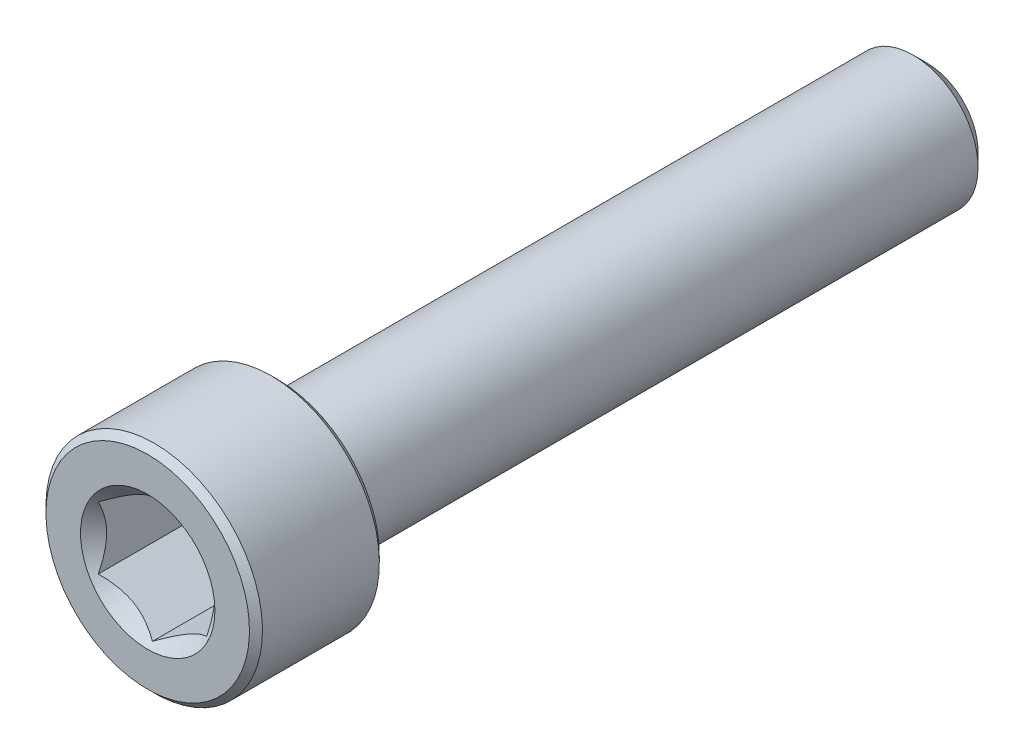
ISO-10303-21;
HEADER;
FILE_DESCRIPTION(('STEP AP214'),'2;1');
FILE_NAME('part.step','',(''),(''),'','','');
FILE_SCHEMA(('AUTOMOTIVE_DESIGN { 1 0 10303 214 1 1 1 1 }'));
ENDSEC;
DATA;
#1=APPLICATION_CONTEXT('core data for automotive mechanical design processes');
#2=APPLICATION_PROTOCOL_DEFINITION('international standard','automotive_design',2000,#1);
#3=PRODUCT_CONTEXT('',#1,'mechanical');
#4=PRODUCT('Part','Part','',(#3));
#5=PRODUCT_RELATED_PRODUCT_CATEGORY('part','',(#4));
#6=PRODUCT_DEFINITION_FORMATION('','',#4);
#7=PRODUCT_DEFINITION_CONTEXT('part definition',#1,'design');
#8=PRODUCT_DEFINITION('design','',#6,#7);
#9=PRODUCT_DEFINITION_SHAPE('','',#8);
#10=(LENGTH_UNIT() NAMED_UNIT(*) SI_UNIT(.MILLI.,.METRE.));
#11=(NAMED_UNIT(*) PLANE_ANGLE_UNIT() SI_UNIT($,.RADIAN.));
#12=(NAMED_UNIT(*) SI_UNIT($,.STERADIAN.) SOLID_ANGLE_UNIT());
#13=UNCERTAINTY_MEASURE_WITH_UNIT(LENGTH_MEASURE(1.E-05),#10,'distance_accuracy_value','');
#14=(GEOMETRIC_REPRESENTATION_CONTEXT(3) GLOBAL_UNCERTAINTY_ASSIGNED_CONTEXT((#13)) GLOBAL_UNIT_ASSIGNED_CONTEXT((#10,
#11,#12)) REPRESENTATION_CONTEXT('',''));
#15=CARTESIAN_POINT('',(0.,0.,0.));
#16=DIRECTION('',(0.,0.,1.));
#17=DIRECTION('',(1.,0.,0.));
#18=AXIS2_PLACEMENT_3D('',#15,#16,#17);
#19=CARTESIAN_POINT('',(0.,2.35048094716167,-18.));
#20=DIRECTION('',(0.,0.,-1.));
#21=DIRECTION('',(0.,1.,0.));
#22=AXIS2_PLACEMENT_3D('',#19,#20,#21);
#23=PLANE('',#22);
#24=CARTESIAN_POINT('',(0.,0.,-18.));
#25=DIRECTION('',(0.,0.,-1.));
#26=DIRECTION('',(0.,1.,0.));
#27=AXIS2_PLACEMENT_3D('',#24,#25,#26);
#28=CIRCLE('',#27,2.35048094716167);
#29=CARTESIAN_POINT('',(0.,2.35048094716167,-18.));
#30=VERTEX_POINT('',#29);
#31=EDGE_CURVE('E51',#30,#30,#28,.T.);
#32=ORIENTED_EDGE('',*,*,#31,.T.);
#33=EDGE_LOOP('',(#32));
#34=FACE_BOUND('',#33,.T.);
#35=ADVANCED_FACE('F38',(#34),#23,.T.);
#36=CARTESIAN_POINT('',(0.,0.,-18.));
#37=DIRECTION('',(0.,0.,1.));
#38=DIRECTION('',(0.,-1.,0.));
#39=AXIS2_PLACEMENT_3D('',#36,#37,#38);
#40=CONICAL_SURFACE('',#39,2.35048094716167,0.785398163397446);
#41=CARTESIAN_POINT('',(0.,0.,-17.3504809471617));
#42=DIRECTION('',(0.,0.,-1.));
#43=DIRECTION('',(0.,1.,0.));
#44=AXIS2_PLACEMENT_3D('',#41,#42,#43);
#45=CIRCLE('',#44,3.);
#46=CARTESIAN_POINT('',(0.,3.,-17.3504809471617));
#47=VERTEX_POINT('',#46);
#48=EDGE_CURVE('E154',#47,#47,#45,.T.);
#49=ORIENTED_EDGE('',*,*,#48,.T.);
#50=EDGE_LOOP('',(#49));
#51=FACE_BOUND('',#50,.T.);
#52=ORIENTED_EDGE('',*,*,#31,.F.);
#53=EDGE_LOOP('',(#52));
#54=FACE_BOUND('',#53,.T.);
#55=ADVANCED_FACE('F160',(#51,#54),#40,.T.);
#56=CARTESIAN_POINT('',(0.,0.,-18.));
#57=DIRECTION('',(0.,0.,-1.));
#58=DIRECTION('',(0.,1.,0.));
#59=AXIS2_PLACEMENT_3D('',#56,#57,#58);
#60=CYLINDRICAL_SURFACE('',#59,3.);
#61=CARTESIAN_POINT('',(0.,0.,11.7));
#62=DIRECTION('',(0.,0.,-1.));
#63=DIRECTION('',(0.,1.,0.));
#64=AXIS2_PLACEMENT_3D('',#61,#62,#63);
#65=CIRCLE('',#64,3.);
#66=CARTESIAN_POINT('',(0.,3.,11.7));
#67=VERTEX_POINT('',#66);
#68=EDGE_CURVE('E151',#67,#67,#65,.T.);
#69=ORIENTED_EDGE('',*,*,#68,.T.);
#70=EDGE_LOOP('',(#69));
#71=FACE_BOUND('',#70,.T.);
#72=ORIENTED_EDGE('',*,*,#48,.F.);
#73=EDGE_LOOP('',(#72));
#74=FACE_BOUND('',#73,.T.);
#75=ADVANCED_FACE('F162',(#71,#74),#60,.T.);
#76=CARTESIAN_POINT('',(0.,0.,11.7));
#77=DIRECTION('',(0.,0.,-1.));
#78=DIRECTION('',(0.,1.,0.));
#79=AXIS2_PLACEMENT_3D('',#76,#77,#78);
#80=TOROIDAL_SURFACE('',#79,3.3,0.3);
#81=CARTESIAN_POINT('',(0.,0.,12.));
#82=DIRECTION('',(0.,0.,-1.));
#83=DIRECTION('',(0.,1.,0.));
#84=AXIS2_PLACEMENT_3D('',#81,#82,#83);
#85=CIRCLE('',#84,3.3);
#86=CARTESIAN_POINT('',(0.,3.3,12.));
#87=VERTEX_POINT('',#86);
#88=EDGE_CURVE('E148',#87,#87,#85,.T.);
#89=ORIENTED_EDGE('',*,*,#88,.T.);
#90=EDGE_LOOP('',(#89));
#91=FACE_BOUND('',#90,.T.);
#92=ORIENTED_EDGE('',*,*,#68,.F.);
#93=EDGE_LOOP('',(#92));
#94=FACE_BOUND('',#93,.T.);
#95=ADVANCED_FACE('F168',(#91,#94),#80,.F.);
#96=CARTESIAN_POINT('',(0.,4.7,12.));
#97=DIRECTION('',(0.,0.,-1.));
#98=DIRECTION('',(0.,1.,0.));
#99=AXIS2_PLACEMENT_3D('',#96,#97,#98);
#100=PLANE('',#99);
#101=CARTESIAN_POINT('',(0.,0.,12.));
#102=DIRECTION('',(0.,0.,-1.));
#103=DIRECTION('',(0.,1.,0.));
#104=AXIS2_PLACEMENT_3D('',#101,#102,#103);
#105=CIRCLE('',#104,4.7);
#106=CARTESIAN_POINT('',(0.,4.7,12.));
#107=VERTEX_POINT('',#106);
#108=EDGE_CURVE('E145',#107,#107,#105,.T.);
#109=ORIENTED_EDGE('',*,*,#108,.T.);
#110=EDGE_LOOP('',(#109));
#111=FACE_BOUND('',#110,.T.);
#112=ORIENTED_EDGE('',*,*,#88,.F.);
#113=EDGE_LOOP('',(#112));
#114=FACE_BOUND('',#113,.T.);
#115=ADVANCED_FACE('F174',(#111,#114),#100,.T.);
#116=CARTESIAN_POINT('',(0.,0.,12.));
#117=DIRECTION('',(0.,0.,1.));
#118=DIRECTION('',(0.,-1.,0.));
#119=AXIS2_PLACEMENT_3D('',#116,#117,#118);
#120=CONICAL_SURFACE('',#119,4.7,0.785398163397445);
#121=CARTESIAN_POINT('',(0.,0.,12.3));
#122=DIRECTION('',(0.,0.,-1.));
#123=DIRECTION('',(0.,1.,0.));
#124=AXIS2_PLACEMENT_3D('',#121,#122,#123);
#125=CIRCLE('',#124,5.);
#126=CARTESIAN_POINT('',(0.,5.,12.3));
#127=VERTEX_POINT('',#126);
#128=EDGE_CURVE('E142',#127,#127,#125,.T.);
#129=ORIENTED_EDGE('',*,*,#128,.T.);
#130=EDGE_LOOP('',(#129));
#131=FACE_BOUND('',#130,.T.);
#132=ORIENTED_EDGE('',*,*,#108,.F.);
#133=EDGE_LOOP('',(#132));
#134=FACE_BOUND('',#133,.T.);
#135=ADVANCED_FACE('F178',(#131,#134),#120,.T.);
#136=CARTESIAN_POINT('',(0.,0.,-18.));
#137=DIRECTION('',(0.,0.,-1.));
#138=DIRECTION('',(0.,1.,0.));
#139=AXIS2_PLACEMENT_3D('',#136,#137,#138);
#140=CYLINDRICAL_SURFACE('',#139,5.);
#141=CARTESIAN_POINT('',(0.,0.,17.7));
#142=DIRECTION('',(0.,0.,-1.));
#143=DIRECTION('',(0.,1.,0.));
#144=AXIS2_PLACEMENT_3D('',#141,#142,#143);
#145=CIRCLE('',#144,5.);
#146=CARTESIAN_POINT('',(0.,5.,17.7));
#147=VERTEX_POINT('',#146);
#148=EDGE_CURVE('E139',#147,#147,#145,.T.);
#149=ORIENTED_EDGE('',*,*,#148,.T.);
#150=EDGE_LOOP('',(#149));
#151=FACE_BOUND('',#150,.T.);
#152=ORIENTED_EDGE('',*,*,#128,.F.);
#153=EDGE_LOOP('',(#152));
#154=FACE_BOUND('',#153,.T.);
#155=ADVANCED_FACE('F182',(#151,#154),#140,.T.);
#156=CARTESIAN_POINT('',(0.,0.,17.7));
#157=DIRECTION('',(0.,0.,-1.));
#158=DIRECTION('',(0.,1.,0.));
#159=AXIS2_PLACEMENT_3D('',#156,#157,#158);
#160=CONICAL_SURFACE('',#159,5.,0.785398163397445);
#161=CARTESIAN_POINT('',(0.,0.,18.));
#162=DIRECTION('',(0.,0.,-1.));
#163=DIRECTION('',(0.,1.,0.));
#164=AXIS2_PLACEMENT_3D('',#161,#162,#163);
#165=CIRCLE('',#164,4.7);
#166=CARTESIAN_POINT('',(0.,4.7,18.));
#167=VERTEX_POINT('',#166);
#168=EDGE_CURVE('E136',#167,#167,#165,.T.);
#169=ORIENTED_EDGE('',*,*,#168,.T.);
#170=EDGE_LOOP('',(#169));
#171=FACE_BOUND('',#170,.T.);
#172=ORIENTED_EDGE('',*,*,#148,.F.);
#173=EDGE_LOOP('',(#172));
#174=FACE_BOUND('',#173,.T.);
#175=ADVANCED_FACE('F186',(#171,#174),#160,.T.);
#176=CARTESIAN_POINT('',(0.,0.,18.));
#177=DIRECTION('',(0.,0.,1.));
#178=DIRECTION('',(0.,-1.,0.));
#179=AXIS2_PLACEMENT_3D('',#176,#177,#178);
#180=PLANE('',#179);
#181=CARTESIAN_POINT('',(0.,0.,18.));
#182=DIRECTION('',(0.,0.,1.));
#183=DIRECTION('',(1.,0.,0.));
#184=AXIS2_PLACEMENT_3D('',#181,#182,#183);
#185=CIRCLE('',#184,3.10325769689424);
#186=CARTESIAN_POINT('',(3.10325769689424,0.,18.));
#187=VERTEX_POINT('',#186);
#188=EDGE_CURVE('E110',#187,#187,#185,.T.);
#189=ORIENTED_EDGE('',*,*,#188,.F.);
#190=EDGE_LOOP('',(#189));
#191=FACE_BOUND('',#190,.T.);
#192=ORIENTED_EDGE('',*,*,#168,.F.);
#193=EDGE_LOOP('',(#192));
#194=FACE_BOUND('',#193,.T.);
#195=ADVANCED_FACE('F190',(#191,#194),#180,.T.);
#196=CARTESIAN_POINT('',(0.,0.,18.));
#197=DIRECTION('',(0.,0.,1.));
#198=DIRECTION('',(1.,0.,0.));
#199=AXIS2_PLACEMENT_3D('',#196,#197,#198);
#200=CONICAL_SURFACE('',#199,3.10325769689424,0.78539816339745);
#201=ORIENTED_EDGE('',*,*,#188,.T.);
#202=EDGE_LOOP('',(#201));
#203=FACE_BOUND('',#202,.T.);
#204=CARTESIAN_POINT('',(-0.000199999999999129,-2.88686681600197,17.7836091260357));
#205=CARTESIAN_POINT('',(0.0857382777877653,-2.83725032818751,17.7340343544086));
#206=CARTESIAN_POINT('',(0.173113567275753,-2.7868041812811,17.6873711304164));
#207=CARTESIAN_POINT('',(0.351281456165589,-2.6839389026696,17.6019317890922));
#208=CARTESIAN_POINT('',(0.442091000681075,-2.6315099876986,17.5632032114599));
#209=CARTESIAN_POINT('',(0.625204123126922,-2.52578957716234,17.4968603529516));
#210=CARTESIAN_POINT('',(0.717461064529341,-2.47252500720904,17.4690793175848));
#211=CARTESIAN_POINT('',(0.904006008776287,-2.3648232334321,17.4262768249646));
#212=CARTESIAN_POINT('',(0.998288312566284,-2.31038931995913,17.4112234157252));
#213=CARTESIAN_POINT('',(1.16077825829185,-2.21657570605387,17.3976413712634));
#214=CARTESIAN_POINT('',(1.22877596788015,-2.17731721011878,17.3956307482947));
#215=CARTESIAN_POINT('',(1.36466024116922,-2.0988643883567,17.3990177662414));
#216=CARTESIAN_POINT('',(1.43254675755224,-2.05967008984862,17.4044180043537));
#217=CARTESIAN_POINT('',(1.56767878823611,-1.98165157555715,17.4223194374564));
#218=CARTESIAN_POINT('',(1.63492349975356,-1.94282782326097,17.4348285761004));
#219=CARTESIAN_POINT('',(1.7682501008182,-1.86585167424616,17.4662611510096));
#220=CARTESIAN_POINT('',(1.83433207909966,-1.82769922629678,17.4851840955507));
#221=CARTESIAN_POINT('',(2.00359634669126,-1.72997445583858,17.5413610104621));
#222=CARTESIAN_POINT('',(2.10572912222289,-1.67100807039231,17.5828494806501));
#223=CARTESIAN_POINT('',(2.25590641494051,-1.58430317001562,17.652887695777));
#224=CARTESIAN_POINT('',(2.30539653988261,-1.55573003305807,17.67749590117));
#225=CARTESIAN_POINT('',(2.40346006383885,-1.49911303110426,17.7289555357691));
#226=CARTESIAN_POINT('',(2.45203400349693,-1.47106885396706,17.7558055878332));
#227=CARTESIAN_POINT('',(2.5002,-1.44326020292023,17.7836091260357));
#228=B_SPLINE_CURVE_WITH_KNOTS('',3,(#204,#205,#206,#207,#208,#209,#210,#211,#212,#213,#214,
#215,#216,#217,#218,#219,#220,#221,#222,#223,#224,#225,#226,#227),.UNSPECIFIED.,.F.,.F.,(4,2,2,
2,2,2,2,2,2,2,2,4),(0.,0.333012085133924,0.667964518301398,0.9975970320433,1.32639954393844,
1.56169424147169,1.79707142102083,2.03271213522171,2.26833478775651,2.64260240809533,
2.82922877818864,3.01574133749025),.UNSPECIFIED.);
#229=CARTESIAN_POINT('',(0.,-2.88675134594813,17.7834936490539));
#230=VERTEX_POINT('',#229);
#231=CARTESIAN_POINT('',(2.5,-1.44337567297406,17.7834936490539));
#232=VERTEX_POINT('',#231);
#233=EDGE_CURVE('E12',#230,#232,#228,.T.);
#234=ORIENTED_EDGE('',*,*,#233,.F.);
#235=CARTESIAN_POINT('',(-2.5002,-1.44326020292023,17.7836091260357));
#236=CARTESIAN_POINT('',(-2.41426172221224,-1.49287669073469,17.7340343544086));
#237=CARTESIAN_POINT('',(-2.32688643272425,-1.5433228376411,17.6873711304164));
#238=CARTESIAN_POINT('',(-2.14871854383441,-1.64618811625259,17.6019317890922));
#239=CARTESIAN_POINT('',(-2.05790899931893,-1.69861703122359,17.5632032114599));
#240=CARTESIAN_POINT('',(-1.87479587687308,-1.80433744175986,17.4968603529516));
#241=CARTESIAN_POINT('',(-1.78253893547066,-1.85760201171316,17.4690793175848));
#242=CARTESIAN_POINT('',(-1.59599399122371,-1.96530378549009,17.4262768249646));
#243=CARTESIAN_POINT('',(-1.50171168743372,-2.01973769896307,17.4112234157252));
#244=CARTESIAN_POINT('',(-1.33922174170816,-2.11355131286833,17.3976413712634));
#245=CARTESIAN_POINT('',(-1.27122403211985,-2.15280980880341,17.3956307482947));
#246=CARTESIAN_POINT('',(-1.13533975883078,-2.23126263056549,17.3990177662414));
#247=CARTESIAN_POINT('',(-1.06745324244776,-2.27045692907358,17.4044180043537));
#248=CARTESIAN_POINT('',(-0.932321211763895,-2.34847544336505,17.4223194374564));
#249=CARTESIAN_POINT('',(-0.865076500246441,-2.38729919566123,17.4348285761004));
#250=CARTESIAN_POINT('',(-0.731749899181802,-2.46427534467604,17.4662611510096));
#251=CARTESIAN_POINT('',(-0.665667920900344,-2.50242779262542,17.4851840955507));
#252=CARTESIAN_POINT('',(-0.496403653308737,-2.60015256308362,17.5413610104621));
#253=CARTESIAN_POINT('',(-0.394270877777109,-2.65911894852989,17.5828494806501));
#254=CARTESIAN_POINT('',(-0.244093585059493,-2.74582384890657,17.652887695777));
#255=CARTESIAN_POINT('',(-0.194603460117392,-2.77439698586412,17.67749590117));
#256=CARTESIAN_POINT('',(-0.0965399361611526,-2.83101398781794,17.7289555357691));
#257=CARTESIAN_POINT('',(-0.0479659965030708,-2.85905816495513,17.7558055878333));
#258=CARTESIAN_POINT('',(0.000200000000001979,-2.88686681600197,17.7836091260357));
#259=B_SPLINE_CURVE_WITH_KNOTS('',3,(#235,#236,#237,#238,#239,#240,#241,#242,#243,#244,#245,
#246,#247,#248,#249,#250,#251,#252,#253,#254,#255,#256,#257,#258),.UNSPECIFIED.,.F.,.F.,(4,2,2,
2,2,2,2,2,2,2,2,4),(0.,0.333012085133922,0.667964518301396,0.997597032043298,1.32639954393844,
1.56169424147168,1.79707142102083,2.03271213522171,2.2683347877565,2.64260240809533,
2.82922877818864,3.01574133749025),.UNSPECIFIED.);
#260=CARTESIAN_POINT('',(-2.5,-1.44337567297407,17.7834936490539));
#261=VERTEX_POINT('',#260);
#262=EDGE_CURVE('E96',#261,#230,#259,.T.);
#263=ORIENTED_EDGE('',*,*,#262,.F.);
#264=CARTESIAN_POINT('',(-2.5,-3.0404429247869,18.8330214063817));
#265=CARTESIAN_POINT('',(-2.5,-2.96709478172557,18.7763788487171));
#266=CARTESIAN_POINT('',(-2.5,-2.89335465135762,18.7202359693275));
#267=CARTESIAN_POINT('',(-2.5,-2.74492905640712,18.6091787819783));
#268=CARTESIAN_POINT('',(-2.5,-2.67024337493575,18.5542647641906));
#269=CARTESIAN_POINT('',(-2.5,-2.51921990828824,18.4455038420407));
#270=CARTESIAN_POINT('',(-2.5,-2.44287382770906,18.391668419147));
#271=CARTESIAN_POINT('',(-2.5,-2.28891665120372,18.2858441602624));
#272=CARTESIAN_POINT('',(-2.5,-2.21130564250585,18.2338551977208));
#273=CARTESIAN_POINT('',(-2.5,-2.04951799142745,18.1288457042913));
#274=CARTESIAN_POINT('',(-2.5,-1.96524215656549,18.0759772332794));
#275=CARTESIAN_POINT('',(-2.5,-1.79473490703969,17.9734987026906));
#276=CARTESIAN_POINT('',(-2.5,-1.70850374831488,17.9238882199388));
#277=CARTESIAN_POINT('',(-2.5,-1.53401833929875,17.8289545270337));
#278=CARTESIAN_POINT('',(-2.5,-1.44577065756376,17.7836193384592));
#279=CARTESIAN_POINT('',(-2.5,-1.26676310994809,17.6982604224777));
#280=CARTESIAN_POINT('',(-2.5,-1.17600446376454,17.658234169168));
#281=CARTESIAN_POINT('',(-2.5,-1.00118351570532,17.5886962875671));
#282=CARTESIAN_POINT('',(-2.5,-0.917385051629539,17.5585280842829));
#283=CARTESIAN_POINT('',(-2.5,-0.747629060099934,17.5048969377877));
#284=CARTESIAN_POINT('',(-2.5,-0.661671397551608,17.4814344152734));
#285=CARTESIAN_POINT('',(-2.5,-0.48962208120087,17.4428857605003));
#286=CARTESIAN_POINT('',(-2.5,-0.403565521298252,17.4276456482725));
#287=CARTESIAN_POINT('',(-2.5,-0.23035238962982,17.4058639492467));
#288=CARTESIAN_POINT('',(-2.5,-0.143196059113863,17.3993204870893));
#289=CARTESIAN_POINT('',(-2.5,0.027361229544661,17.395504167584));
#290=CARTESIAN_POINT('',(-2.5,0.110753131974795,17.3978241071313));
#291=CARTESIAN_POINT('',(-2.5,0.276898134935752,17.4106653349727));
#292=CARTESIAN_POINT('',(-2.5,0.359651177707741,17.421187356241));
#293=CARTESIAN_POINT('',(-2.5,0.52532592779518,17.4500114990314));
#294=CARTESIAN_POINT('',(-2.5,0.608223175291062,17.4684520406654));
#295=CARTESIAN_POINT('',(-2.5,0.772178834557463,17.5120846864152));
#296=CARTESIAN_POINT('',(-2.5,0.853237339741923,17.5372764467107));
#297=CARTESIAN_POINT('',(-2.5,1.10159689599554,17.6241193926927));
#298=CARTESIAN_POINT('',(-2.5,1.2655525401235,17.6953668377804));
#299=CARTESIAN_POINT('',(-2.5,1.50551769780195,17.8142345481021));
#300=CARTESIAN_POINT('',(-2.5,1.58465788064154,17.8559484521643));
#301=CARTESIAN_POINT('',(-2.5,1.74114816885993,17.9426161601922));
#302=CARTESIAN_POINT('',(-2.5,1.81849858456147,17.9875693968529));
#303=CARTESIAN_POINT('',(-2.5,1.96784059769267,18.0777853522682));
#304=CARTESIAN_POINT('',(-2.5,2.03990833441822,18.1229234485208));
#305=CARTESIAN_POINT('',(-2.5,2.18280709640722,18.2151257428437));
#306=CARTESIAN_POINT('',(-2.5,2.25363802857339,18.2621900850232));
#307=CARTESIAN_POINT('',(-2.5,2.39365462675841,18.3575181428367));
#308=CARTESIAN_POINT('',(-2.5,2.46284892785042,18.405769227967));
#309=CARTESIAN_POINT('',(-2.5,2.60028772768958,18.5035675953205));
#310=CARTESIAN_POINT('',(-2.5,2.66853248306037,18.5531145164816));
#311=CARTESIAN_POINT('',(-2.5,2.73637900498552,18.6031920948776));
#312=B_SPLINE_CURVE_WITH_KNOTS('',3,(#264,#265,#266,#267,#268,#269,#270,#271,#272,#273,#274,
#275,#276,#277,#278,#279,#280,#281,#282,#283,#284,#285,#286,#287,#288,#289,#290,#291,#292,#293,
#294,#295,#296,#297,#298,#299,#300,#301,#302,#303,#304,#305,#306,#307,#308,#309,#310,#311),
.UNSPECIFIED.,.F.,.F.,(4,2,2,2,2,2,2,2,2,2,2,2,2,2,2,2,2,2,2,2,2,2,2,4),(0.,0.278024739230087,
0.556114450273836,0.836346737531474,1.11655978131475,1.41496015304213,1.71332168905072,
2.01082076966666,2.30817779353377,2.57513879386764,2.84211653895115,3.10390388797607,
3.36563477559628,3.61548897009284,3.86536549522731,4.11980016461986,4.37422187884309,
4.90887010890445,5.17722912654036,5.44554126009378,5.70061957252692,5.95571700326383,
6.20877059828287,6.46175442014512),.UNSPECIFIED.);
#313=CARTESIAN_POINT('',(-2.5,1.44337567297406,17.7834936490539));
#314=VERTEX_POINT('',#313);
#315=EDGE_CURVE('E109',#314,#261,#312,.F.);
#316=ORIENTED_EDGE('',*,*,#315,.F.);
#317=CARTESIAN_POINT('',(0.000199999999999144,2.88686681600197,17.7836091260357));
#318=CARTESIAN_POINT('',(-0.0857382777877659,2.83725032818751,17.7340343544086));
#319=CARTESIAN_POINT('',(-0.173113567275754,2.7868041812811,17.6873711304164));
#320=CARTESIAN_POINT('',(-0.35128145616559,2.6839389026696,17.6019317890922));
#321=CARTESIAN_POINT('',(-0.442091000681075,2.6315099876986,17.5632032114599));
#322=CARTESIAN_POINT('',(-0.625204123126921,2.52578957716234,17.4968603529516));
#323=CARTESIAN_POINT('',(-0.71746106452934,2.47252500720904,17.4690793175848));
#324=CARTESIAN_POINT('',(-0.904006008776286,2.3648232334321,17.4262768249646));
#325=CARTESIAN_POINT('',(-0.998288312566284,2.31038931995913,17.4112234157252));
#326=CARTESIAN_POINT('',(-1.16077825829185,2.21657570605387,17.3976413712634));
#327=CARTESIAN_POINT('',(-1.22877596788015,2.17731721011878,17.3956307482947));
#328=CARTESIAN_POINT('',(-1.36466024116922,2.0988643883567,17.3990177662414));
#329=CARTESIAN_POINT('',(-1.43254675755224,2.05967008984862,17.4044180043537));
#330=CARTESIAN_POINT('',(-1.56767878823611,1.98165157555715,17.4223194374564));
#331=CARTESIAN_POINT('',(-1.63492349975356,1.94282782326096,17.4348285761004));
#332=CARTESIAN_POINT('',(-1.7682501008182,1.86585167424616,17.4662611510096));
#333=CARTESIAN_POINT('',(-1.83433207909966,1.82769922629677,17.4851840955507));
#334=CARTESIAN_POINT('',(-2.00359634669126,1.72997445583858,17.5413610104621));
#335=CARTESIAN_POINT('',(-2.10572912222289,1.67100807039231,17.5828494806501));
#336=CARTESIAN_POINT('',(-2.25590641494051,1.58430317001562,17.652887695777));
#337=CARTESIAN_POINT('',(-2.30539653988261,1.55573003305807,17.67749590117));
#338=CARTESIAN_POINT('',(-2.40346006383885,1.49911303110425,17.7289555357691));
#339=CARTESIAN_POINT('',(-2.45203400349693,1.47106885396706,17.7558055878332));
#340=CARTESIAN_POINT('',(-2.5002,1.44326020292023,17.7836091260357));
#341=B_SPLINE_CURVE_WITH_KNOTS('',3,(#317,#318,#319,#320,#321,#322,#323,#324,#325,#326,#327,
#328,#329,#330,#331,#332,#333,#334,#335,#336,#337,#338,#339,#340),.UNSPECIFIED.,.F.,.F.,(4,2,2,
2,2,2,2,2,2,2,2,4),(0.,0.333012085133924,0.667964518301396,0.997597032043298,1.32639954393844,
1.56169424147169,1.79707142102083,2.03271213522171,2.26833478775651,2.64260240809533,
2.82922877818863,3.01574133749025),.UNSPECIFIED.);
#342=CARTESIAN_POINT('',(0.,2.88675134594813,17.7834936490539));
#343=VERTEX_POINT('',#342);
#344=EDGE_CURVE('E240',#343,#314,#341,.T.);
#345=ORIENTED_EDGE('',*,*,#344,.F.);
#346=CARTESIAN_POINT('',(2.5002,1.44326020292023,17.7836091260357));
#347=CARTESIAN_POINT('',(2.41426172221224,1.49287669073469,17.7340343544086));
#348=CARTESIAN_POINT('',(2.32688643272425,1.5433228376411,17.6873711304164));
#349=CARTESIAN_POINT('',(2.14871854383441,1.64618811625259,17.6019317890922));
#350=CARTESIAN_POINT('',(2.05790899931893,1.69861703122359,17.5632032114599));
#351=CARTESIAN_POINT('',(1.87479587687308,1.80433744175986,17.4968603529516));
#352=CARTESIAN_POINT('',(1.78253893547066,1.85760201171315,17.4690793175848));
#353=CARTESIAN_POINT('',(1.59599399122371,1.96530378549009,17.4262768249646));
#354=CARTESIAN_POINT('',(1.50171168743372,2.01973769896307,17.4112234157252));
#355=CARTESIAN_POINT('',(1.33922174170815,2.11355131286833,17.3976413712634));
#356=CARTESIAN_POINT('',(1.27122403211985,2.15280980880341,17.3956307482947));
#357=CARTESIAN_POINT('',(1.13533975883078,2.23126263056549,17.3990177662414));
#358=CARTESIAN_POINT('',(1.06745324244776,2.27045692907357,17.4044180043537));
#359=CARTESIAN_POINT('',(0.932321211763894,2.34847544336505,17.4223194374564));
#360=CARTESIAN_POINT('',(0.865076500246439,2.38729919566123,17.4348285761004));
#361=CARTESIAN_POINT('',(0.7317498991818,2.46427534467603,17.4662611510096));
#362=CARTESIAN_POINT('',(0.665667920900342,2.50242779262542,17.4851840955507));
#363=CARTESIAN_POINT('',(0.496403653308735,2.60015256308362,17.5413610104621));
#364=CARTESIAN_POINT('',(0.394270877777107,2.65911894852989,17.5828494806501));
#365=CARTESIAN_POINT('',(0.244093585059491,2.74582384890657,17.652887695777));
#366=CARTESIAN_POINT('',(0.194603460117391,2.77439698586412,17.67749590117));
#367=CARTESIAN_POINT('',(0.0965399361611528,2.83101398781794,17.7289555357691));
#368=CARTESIAN_POINT('',(0.0479659965030715,2.85905816495513,17.7558055878332));
#369=CARTESIAN_POINT('',(-0.00020000000000044,2.88686681600197,17.7836091260357));
#370=B_SPLINE_CURVE_WITH_KNOTS('',3,(#346,#347,#348,#349,#350,#351,#352,#353,#354,#355,#356,
#357,#358,#359,#360,#361,#362,#363,#364,#365,#366,#367,#368,#369),.UNSPECIFIED.,.F.,.F.,(4,2,2,
2,2,2,2,2,2,2,2,4),(0.,0.333012085133924,0.667964518301396,0.997597032043299,1.32639954393844,
1.56169424147169,1.79707142102083,2.03271213522171,2.26833478775651,2.64260240809533,
2.82922877818864,3.01574133749025),.UNSPECIFIED.);
#371=CARTESIAN_POINT('',(2.5,1.44337567297406,17.7834936490539));
#372=VERTEX_POINT('',#371);
#373=EDGE_CURVE('E213',#372,#343,#370,.T.);
#374=ORIENTED_EDGE('',*,*,#373,.F.);
#375=CARTESIAN_POINT('',(2.5,-3.0404429247869,18.8330214063817));
#376=CARTESIAN_POINT('',(2.5,-2.96709478172557,18.7763788487171));
#377=CARTESIAN_POINT('',(2.5,-2.89335465135762,18.7202359693275));
#378=CARTESIAN_POINT('',(2.5,-2.74492905640712,18.6091787819783));
#379=CARTESIAN_POINT('',(2.5,-2.67024337493575,18.5542647641906));
#380=CARTESIAN_POINT('',(2.5,-2.51921990828824,18.4455038420407));
#381=CARTESIAN_POINT('',(2.5,-2.44287382770906,18.391668419147));
#382=CARTESIAN_POINT('',(2.5,-2.28891665120372,18.2858441602624));
#383=CARTESIAN_POINT('',(2.5,-2.21130564250584,18.2338551977208));
#384=CARTESIAN_POINT('',(2.5,-2.04951799142744,18.1288457042913));
#385=CARTESIAN_POINT('',(2.5,-1.96524215656549,18.0759772332794));
#386=CARTESIAN_POINT('',(2.5,-1.79473490703968,17.9734987026906));
#387=CARTESIAN_POINT('',(2.5,-1.70850374831487,17.9238882199388));
#388=CARTESIAN_POINT('',(2.5,-1.53401833929875,17.8289545270337));
#389=CARTESIAN_POINT('',(2.5,-1.44577065756376,17.7836193384592));
#390=CARTESIAN_POINT('',(2.5,-1.26676310994808,17.6982604224777));
#391=CARTESIAN_POINT('',(2.5,-1.17600446376454,17.658234169168));
#392=CARTESIAN_POINT('',(2.5,-1.00118351570532,17.5886962875671));
#393=CARTESIAN_POINT('',(2.5,-0.917385051629537,17.5585280842829));
#394=CARTESIAN_POINT('',(2.5,-0.747629060099932,17.5048969377877));
#395=CARTESIAN_POINT('',(2.5,-0.661671397551606,17.4814344152734));
#396=CARTESIAN_POINT('',(2.5,-0.489622081200869,17.4428857605003));
#397=CARTESIAN_POINT('',(2.5,-0.403565521298251,17.4276456482725));
#398=CARTESIAN_POINT('',(2.5,-0.230352389629819,17.4058639492467));
#399=CARTESIAN_POINT('',(2.5,-0.143196059113862,17.3993204870893));
#400=CARTESIAN_POINT('',(2.5,0.0273612295446616,17.395504167584));
#401=CARTESIAN_POINT('',(2.5,0.110753131974796,17.3978241071313));
#402=CARTESIAN_POINT('',(2.5,0.276898134935753,17.4106653349727));
#403=CARTESIAN_POINT('',(2.5,0.359651177707741,17.421187356241));
#404=CARTESIAN_POINT('',(2.5,0.525325927795179,17.4500114990314));
#405=CARTESIAN_POINT('',(2.5,0.608223175291062,17.4684520406654));
#406=CARTESIAN_POINT('',(2.5,0.772178834557462,17.5120846864152));
#407=CARTESIAN_POINT('',(2.5,0.853237339741923,17.5372764467107));
#408=CARTESIAN_POINT('',(2.5,1.10159689599554,17.6241193926927));
#409=CARTESIAN_POINT('',(2.5,1.2655525401235,17.6953668377804));
#410=CARTESIAN_POINT('',(2.5,1.50551769780196,17.8142345481021));
#411=CARTESIAN_POINT('',(2.5,1.58465788064155,17.8559484521643));
#412=CARTESIAN_POINT('',(2.5,1.74114816885993,17.9426161601922));
#413=CARTESIAN_POINT('',(2.5,1.81849858456147,17.9875693968529));
#414=CARTESIAN_POINT('',(2.5,1.96784059769267,18.0777853522682));
#415=CARTESIAN_POINT('',(2.5,2.03990833441822,18.1229234485208));
#416=CARTESIAN_POINT('',(2.5,2.18280709640722,18.2151257428437));
#417=CARTESIAN_POINT('',(2.5,2.2536380285734,18.2621900850232));
#418=CARTESIAN_POINT('',(2.5,2.39365462675841,18.3575181428367));
#419=CARTESIAN_POINT('',(2.5,2.46284892785042,18.405769227967));
#420=CARTESIAN_POINT('',(2.5,2.60028772768958,18.5035675953205));
#421=CARTESIAN_POINT('',(2.5,2.66853248306037,18.5531145164816));
#422=CARTESIAN_POINT('',(2.5,2.73637900498552,18.6031920948776));
#423=B_SPLINE_CURVE_WITH_KNOTS('',3,(#375,#376,#377,#378,#379,#380,#381,#382,#383,#384,#385,
#386,#387,#388,#389,#390,#391,#392,#393,#394,#395,#396,#397,#398,#399,#400,#401,#402,#403,#404,
#405,#406,#407,#408,#409,#410,#411,#412,#413,#414,#415,#416,#417,#418,#419,#420,#421,#422),
.UNSPECIFIED.,.F.,.F.,(4,2,2,2,2,2,2,2,2,2,2,2,2,2,2,2,2,2,2,2,2,2,2,4),(0.,0.278024739230089,
0.556114450273835,0.836346737531471,1.11655978131475,1.41496015304214,1.71332168905072,
2.01082076966666,2.30817779353377,2.57513879386763,2.84211653895115,3.10390388797607,
3.36563477559628,3.61548897009283,3.86536549522731,4.11980016461985,4.37422187884308,
4.90887010890445,5.17722912654036,5.44554126009378,5.70061957252692,5.95571700326382,
6.20877059828286,6.46175442014511),.UNSPECIFIED.);
#424=EDGE_CURVE('E58',#232,#372,#423,.T.);
#425=ORIENTED_EDGE('',*,*,#424,.F.);
#426=EDGE_LOOP('',(#234,#263,#316,#345,#374,#425));
#427=FACE_BOUND('',#426,.T.);
#428=ADVANCED_FACE('F95',(#203,#427),#200,.F.);
#429=CARTESIAN_POINT('',(0.,4.7,13.));
#430=DIRECTION('',(0.,0.,-1.));
#431=DIRECTION('',(0.,1.,0.));
#432=AXIS2_PLACEMENT_3D('',#429,#430,#431);
#433=PLANE('',#432);
#434=DIRECTION('',(0.866025403784438,0.5,0.));
#435=VECTOR('',#434,1.);
#436=CARTESIAN_POINT('',(0.,-2.88675134594813,13.));
#437=LINE('',#436,#435);
#438=CARTESIAN_POINT('',(0.,-2.88675134594813,13.));
#439=VERTEX_POINT('',#438);
#440=CARTESIAN_POINT('',(2.5,-1.44337567297406,13.));
#441=VERTEX_POINT('',#440);
#442=EDGE_CURVE('E113',#439,#441,#437,.T.);
#443=ORIENTED_EDGE('',*,*,#442,.T.);
#444=DIRECTION('',(0.,1.,0.));
#445=VECTOR('',#444,1.);
#446=CARTESIAN_POINT('',(2.5,-1.44337567297406,13.));
#447=LINE('',#446,#445);
#448=CARTESIAN_POINT('',(2.5,1.44337567297406,13.));
#449=VERTEX_POINT('',#448);
#450=EDGE_CURVE('E65',#441,#449,#447,.T.);
#451=ORIENTED_EDGE('',*,*,#450,.T.);
#452=DIRECTION('',(-0.866025403784439,0.5,0.));
#453=VECTOR('',#452,1.);
#454=CARTESIAN_POINT('',(2.5,1.44337567297406,13.));
#455=LINE('',#454,#453);
#456=CARTESIAN_POINT('',(0.,2.88675134594813,13.));
#457=VERTEX_POINT('',#456);
#458=EDGE_CURVE('E121',#449,#457,#455,.T.);
#459=ORIENTED_EDGE('',*,*,#458,.T.);
#460=DIRECTION('',(-0.866025403784438,-0.5,0.));
#461=VECTOR('',#460,1.);
#462=CARTESIAN_POINT('',(0.,2.88675134594813,13.));
#463=LINE('',#462,#461);
#464=CARTESIAN_POINT('',(-2.5,1.44337567297406,13.));
#465=VERTEX_POINT('',#464);
#466=EDGE_CURVE('E128',#457,#465,#463,.T.);
#467=ORIENTED_EDGE('',*,*,#466,.T.);
#468=DIRECTION('',(0.,-1.,0.));
#469=VECTOR('',#468,1.);
#470=CARTESIAN_POINT('',(-2.5,1.44337567297406,13.));
#471=LINE('',#470,#469);
#472=CARTESIAN_POINT('',(-2.5,-1.44337567297406,13.));
#473=VERTEX_POINT('',#472);
#474=EDGE_CURVE('E124',#465,#473,#471,.T.);
#475=ORIENTED_EDGE('',*,*,#474,.T.);
#476=DIRECTION('',(0.866025403784439,-0.5,0.));
#477=VECTOR('',#476,1.);
#478=CARTESIAN_POINT('',(-2.5,-1.44337567297407,13.));
#479=LINE('',#478,#477);
#480=EDGE_CURVE('E114',#473,#439,#479,.T.);
#481=ORIENTED_EDGE('',*,*,#480,.T.);
#482=EDGE_LOOP('',(#443,#451,#459,#467,#475,#481));
#483=FACE_BOUND('',#482,.T.);
#484=ADVANCED_FACE('F195',(#483),#433,.F.);
#485=CARTESIAN_POINT('',(0.,-2.88675134594813,4.36237384174027));
#486=DIRECTION('',(0.5,-0.866025403784438,0.));
#487=DIRECTION('',(0.866025403784438,0.5,0.));
#488=AXIS2_PLACEMENT_3D('',#485,#486,#487);
#489=PLANE('',#488);
#490=DIRECTION('',(0.,0.,1.));
#491=VECTOR('',#490,1.);
#492=CARTESIAN_POINT('',(0.,-2.88675134594813,4.36237384174027));
#493=LINE('',#492,#491);
#494=EDGE_CURVE('E105',#439,#230,#493,.T.);
#495=ORIENTED_EDGE('',*,*,#494,.T.);
#496=ORIENTED_EDGE('',*,*,#233,.T.);
#497=DIRECTION('',(0.,0.,1.));
#498=VECTOR('',#497,1.);
#499=CARTESIAN_POINT('',(2.5,-1.44337567297406,4.36237384174027));
#500=LINE('',#499,#498);
#501=EDGE_CURVE('E116',#441,#232,#500,.T.);
#502=ORIENTED_EDGE('',*,*,#501,.F.);
#503=ORIENTED_EDGE('',*,*,#442,.F.);
#504=EDGE_LOOP('',(#495,#496,#502,#503));
#505=FACE_BOUND('',#504,.T.);
#506=ADVANCED_FACE('F112',(#505),#489,.F.);
#507=CARTESIAN_POINT('',(-2.5,-1.44337567297407,4.36237384174027));
#508=DIRECTION('',(-0.5,-0.866025403784439,0.));
#509=DIRECTION('',(0.866025403784439,-0.5,0.));
#510=AXIS2_PLACEMENT_3D('',#507,#508,#509);
#511=PLANE('',#510);
#512=DIRECTION('',(0.,0.,1.));
#513=VECTOR('',#512,1.);
#514=CARTESIAN_POINT('',(-2.5,-1.44337567297407,4.36237384174027));
#515=LINE('',#514,#513);
#516=EDGE_CURVE('E108',#473,#261,#515,.T.);
#517=ORIENTED_EDGE('',*,*,#516,.T.);
#518=ORIENTED_EDGE('',*,*,#262,.T.);
#519=ORIENTED_EDGE('',*,*,#494,.F.);
#520=ORIENTED_EDGE('',*,*,#480,.F.);
#521=EDGE_LOOP('',(#517,#518,#519,#520));
#522=FACE_BOUND('',#521,.T.);
#523=ADVANCED_FACE('F104',(#522),#511,.F.);
#524=CARTESIAN_POINT('',(-2.5,1.44337567297406,4.36237384174027));
#525=DIRECTION('',(-1.,0.,0.));
#526=DIRECTION('',(0.,0.,1.));
#527=AXIS2_PLACEMENT_3D('',#524,#525,#526);
#528=PLANE('',#527);
#529=DIRECTION('',(0.,0.,1.));
#530=VECTOR('',#529,1.);
#531=CARTESIAN_POINT('',(-2.5,1.44337567297406,4.36237384174027));
#532=LINE('',#531,#530);
#533=EDGE_CURVE('E125',#465,#314,#532,.T.);
#534=ORIENTED_EDGE('',*,*,#533,.T.);
#535=ORIENTED_EDGE('',*,*,#315,.T.);
#536=ORIENTED_EDGE('',*,*,#516,.F.);
#537=ORIENTED_EDGE('',*,*,#474,.F.);
#538=EDGE_LOOP('',(#534,#535,#536,#537));
#539=FACE_BOUND('',#538,.T.);
#540=ADVANCED_FACE('F249',(#539),#528,.F.);
#541=CARTESIAN_POINT('',(0.,2.88675134594813,4.36237384174027));
#542=DIRECTION('',(-0.5,0.866025403784438,0.));
#543=DIRECTION('',(-0.866025403784438,-0.5,0.));
#544=AXIS2_PLACEMENT_3D('',#541,#542,#543);
#545=PLANE('',#544);
#546=DIRECTION('',(0.,0.,1.));
#547=VECTOR('',#546,1.);
#548=CARTESIAN_POINT('',(0.,2.88675134594813,4.36237384174027));
#549=LINE('',#548,#547);
#550=EDGE_CURVE('E129',#457,#343,#549,.T.);
#551=ORIENTED_EDGE('',*,*,#550,.T.);
#552=ORIENTED_EDGE('',*,*,#344,.T.);
#553=ORIENTED_EDGE('',*,*,#533,.F.);
#554=ORIENTED_EDGE('',*,*,#466,.F.);
#555=EDGE_LOOP('',(#551,#552,#553,#554));
#556=FACE_BOUND('',#555,.T.);
#557=ADVANCED_FACE('F246',(#556),#545,.F.);
#558=CARTESIAN_POINT('',(2.5,1.44337567297406,4.36237384174027));
#559=DIRECTION('',(0.5,0.866025403784439,0.));
#560=DIRECTION('',(-0.866025403784439,0.5,0.));
#561=AXIS2_PLACEMENT_3D('',#558,#559,#560);
#562=PLANE('',#561);
#563=DIRECTION('',(0.,0.,1.));
#564=VECTOR('',#563,1.);
#565=CARTESIAN_POINT('',(2.5,1.44337567297406,4.36237384174027));
#566=LINE('',#565,#564);
#567=EDGE_CURVE('E132',#449,#372,#566,.T.);
#568=ORIENTED_EDGE('',*,*,#567,.T.);
#569=ORIENTED_EDGE('',*,*,#373,.T.);
#570=ORIENTED_EDGE('',*,*,#550,.F.);
#571=ORIENTED_EDGE('',*,*,#458,.F.);
#572=EDGE_LOOP('',(#568,#569,#570,#571));
#573=FACE_BOUND('',#572,.T.);
#574=ADVANCED_FACE('F203',(#573),#562,.F.);
#575=CARTESIAN_POINT('',(2.5,-1.44337567297406,4.36237384174027));
#576=DIRECTION('',(1.,0.,0.));
#577=DIRECTION('',(0.,0.,-1.));
#578=AXIS2_PLACEMENT_3D('',#575,#576,#577);
#579=PLANE('',#578);
#580=ORIENTED_EDGE('',*,*,#501,.T.);
#581=ORIENTED_EDGE('',*,*,#424,.T.);
#582=ORIENTED_EDGE('',*,*,#567,.F.);
#583=ORIENTED_EDGE('',*,*,#450,.F.);
#584=EDGE_LOOP('',(#580,#581,#582,#583));
#585=FACE_BOUND('',#584,.T.);
#586=ADVANCED_FACE('F199',(#585),#579,.F.);
#587=CLOSED_SHELL('',(#35,#55,#75,#95,#115,#135,#155,#175,#195,#428,#484,#506,#523,#540,#557,
#574,#586));
#588=MANIFOLD_SOLID_BREP('B2',#587);
#589=ADVANCED_BREP_SHAPE_REPRESENTATION('',(#18,#588),#14);
#590=SHAPE_DEFINITION_REPRESENTATION(#9,#589);
ENDSEC;
END-ISO-10303-21;
